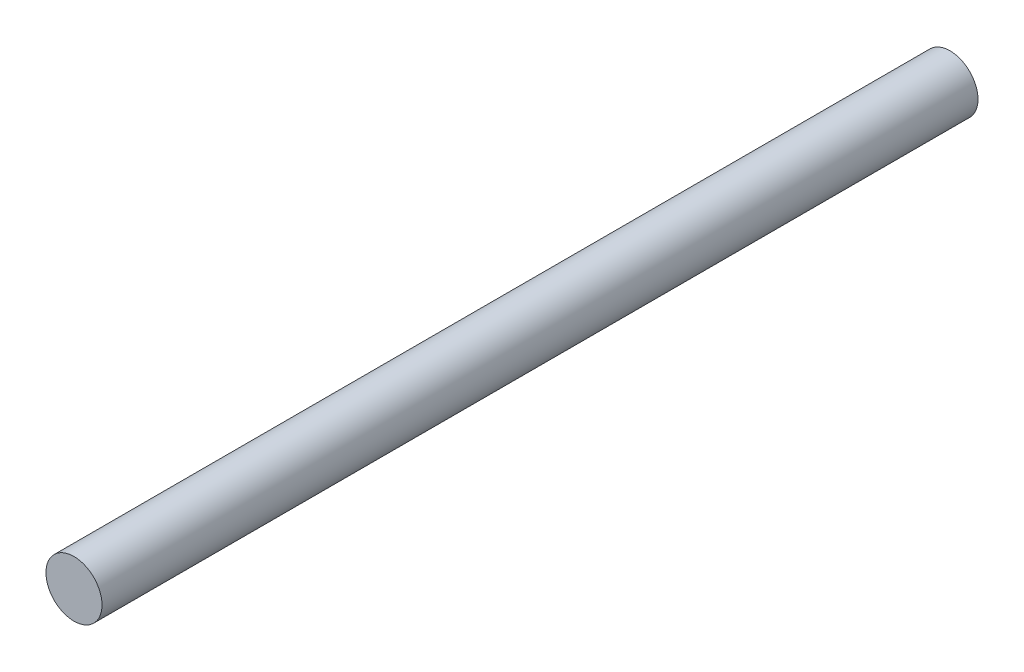
ISO-10303-21;
HEADER;
FILE_DESCRIPTION(('STEP AP214'),'2;1');
FILE_NAME('part.step','',(''),(''),'','','');
FILE_SCHEMA(('AUTOMOTIVE_DESIGN { 1 0 10303 214 1 1 1 1 }'));
ENDSEC;
DATA;
#1=APPLICATION_CONTEXT('core data for automotive mechanical design processes');
#2=APPLICATION_PROTOCOL_DEFINITION('international standard','automotive_design',2000,#1);
#3=PRODUCT_CONTEXT('',#1,'mechanical');
#4=PRODUCT('Part','Part','',(#3));
#5=PRODUCT_RELATED_PRODUCT_CATEGORY('part','',(#4));
#6=PRODUCT_DEFINITION_FORMATION('','',#4);
#7=PRODUCT_DEFINITION_CONTEXT('part definition',#1,'design');
#8=PRODUCT_DEFINITION('design','',#6,#7);
#9=PRODUCT_DEFINITION_SHAPE('','',#8);
#10=(LENGTH_UNIT() NAMED_UNIT(*) SI_UNIT(.MILLI.,.METRE.));
#11=(NAMED_UNIT(*) PLANE_ANGLE_UNIT() SI_UNIT($,.RADIAN.));
#12=(NAMED_UNIT(*) SI_UNIT($,.STERADIAN.) SOLID_ANGLE_UNIT());
#13=UNCERTAINTY_MEASURE_WITH_UNIT(LENGTH_MEASURE(1.E-05),#10,'distance_accuracy_value','');
#14=(GEOMETRIC_REPRESENTATION_CONTEXT(3) GLOBAL_UNCERTAINTY_ASSIGNED_CONTEXT((#13)) GLOBAL_UNIT_ASSIGNED_CONTEXT((#10,
#11,#12)) REPRESENTATION_CONTEXT('',''));
#15=CARTESIAN_POINT('',(0.,0.,0.));
#16=DIRECTION('',(0.,0.,1.));
#17=DIRECTION('',(1.,0.,0.));
#18=AXIS2_PLACEMENT_3D('',#15,#16,#17);
#19=CARTESIAN_POINT('',(0.,0.,250.));
#20=DIRECTION('',(0.,0.,-1.));
#21=DIRECTION('',(-1.,0.,0.));
#22=AXIS2_PLACEMENT_3D('',#19,#20,#21);
#23=CYLINDRICAL_SURFACE('',#22,8.);
#24=CARTESIAN_POINT('',(0.,0.,250.));
#25=DIRECTION('',(0.,0.,1.));
#26=DIRECTION('',(1.,0.,0.));
#27=AXIS2_PLACEMENT_3D('',#24,#25,#26);
#28=CIRCLE('',#27,8.);
#29=CARTESIAN_POINT('',(8.,0.,250.));
#30=VERTEX_POINT('',#29);
#31=EDGE_CURVE('E10',#30,#30,#28,.T.);
#32=ORIENTED_EDGE('',*,*,#31,.F.);
#33=EDGE_LOOP('',(#32));
#34=FACE_BOUND('',#33,.T.);
#35=CARTESIAN_POINT('',(0.,0.,0.));
#36=DIRECTION('',(0.,0.,1.));
#37=DIRECTION('',(1.,0.,0.));
#38=AXIS2_PLACEMENT_3D('',#35,#36,#37);
#39=CIRCLE('',#38,8.);
#40=CARTESIAN_POINT('',(8.,0.,0.));
#41=VERTEX_POINT('',#40);
#42=EDGE_CURVE('E36',#41,#41,#39,.T.);
#43=ORIENTED_EDGE('',*,*,#42,.T.);
#44=EDGE_LOOP('',(#43));
#45=FACE_BOUND('',#44,.T.);
#46=ADVANCED_FACE('F33',(#34,#45),#23,.T.);
#47=CARTESIAN_POINT('',(0.,0.,250.));
#48=DIRECTION('',(0.,0.,1.));
#49=DIRECTION('',(1.,0.,0.));
#50=AXIS2_PLACEMENT_3D('',#47,#48,#49);
#51=PLANE('',#50);
#52=ORIENTED_EDGE('',*,*,#31,.T.);
#53=EDGE_LOOP('',(#52));
#54=FACE_BOUND('',#53,.T.);
#55=ADVANCED_FACE('F48',(#54),#51,.T.);
#56=CARTESIAN_POINT('',(0.,0.,0.));
#57=DIRECTION('',(0.,0.,1.));
#58=DIRECTION('',(1.,0.,0.));
#59=AXIS2_PLACEMENT_3D('',#56,#57,#58);
#60=PLANE('',#59);
#61=ORIENTED_EDGE('',*,*,#42,.F.);
#62=EDGE_LOOP('',(#61));
#63=FACE_BOUND('',#62,.T.);
#64=ADVANCED_FACE('F46',(#63),#60,.F.);
#65=CLOSED_SHELL('',(#46,#55,#64));
#66=MANIFOLD_SOLID_BREP('B2',#65);
#67=ADVANCED_BREP_SHAPE_REPRESENTATION('',(#18,#66),#14);
#68=SHAPE_DEFINITION_REPRESENTATION(#9,#67);
ENDSEC;
END-ISO-10303-21;
